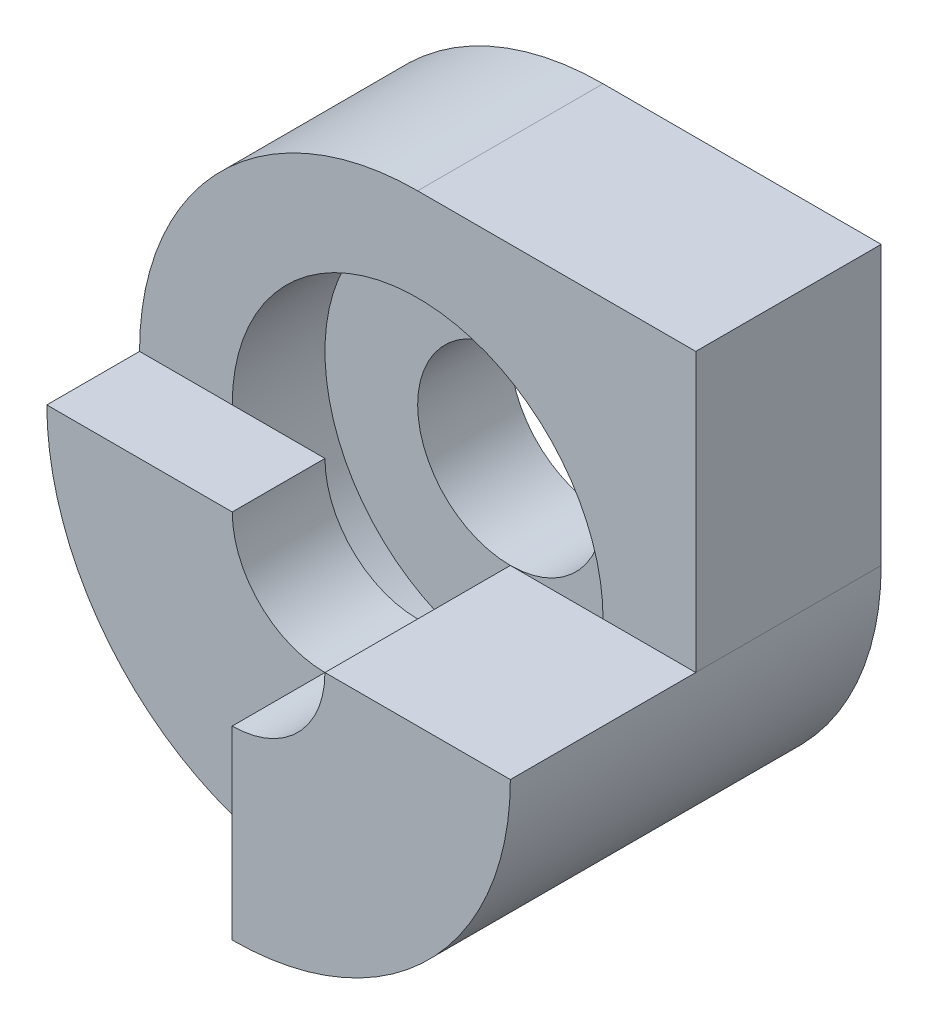
ISO-10303-21;
HEADER;
FILE_DESCRIPTION(('STEP AP214'),'2;1');
FILE_NAME('part.step','',(''),(''),'','','');
FILE_SCHEMA(('AUTOMOTIVE_DESIGN { 1 0 10303 214 1 1 1 1 }'));
ENDSEC;
DATA;
#1=APPLICATION_CONTEXT('core data for automotive mechanical design processes');
#2=APPLICATION_PROTOCOL_DEFINITION('international standard','automotive_design',2000,#1);
#3=PRODUCT_CONTEXT('',#1,'mechanical');
#4=PRODUCT('Part','Part','',(#3));
#5=PRODUCT_RELATED_PRODUCT_CATEGORY('part','',(#4));
#6=PRODUCT_DEFINITION_FORMATION('','',#4);
#7=PRODUCT_DEFINITION_CONTEXT('part definition',#1,'design');
#8=PRODUCT_DEFINITION('design','',#6,#7);
#9=PRODUCT_DEFINITION_SHAPE('','',#8);
#10=(LENGTH_UNIT() NAMED_UNIT(*) SI_UNIT(.MILLI.,.METRE.));
#11=(NAMED_UNIT(*) PLANE_ANGLE_UNIT() SI_UNIT($,.RADIAN.));
#12=(NAMED_UNIT(*) SI_UNIT($,.STERADIAN.) SOLID_ANGLE_UNIT());
#13=UNCERTAINTY_MEASURE_WITH_UNIT(LENGTH_MEASURE(1.E-05),#10,'distance_accuracy_value','');
#14=(GEOMETRIC_REPRESENTATION_CONTEXT(3) GLOBAL_UNCERTAINTY_ASSIGNED_CONTEXT((#13)) GLOBAL_UNIT_ASSIGNED_CONTEXT((#10,
#11,#12)) REPRESENTATION_CONTEXT('',''));
#15=CARTESIAN_POINT('',(0.,0.,0.));
#16=DIRECTION('',(0.,0.,1.));
#17=DIRECTION('',(1.,0.,0.));
#18=AXIS2_PLACEMENT_3D('',#15,#16,#17);
#19=CARTESIAN_POINT('',(0.,0.,2.));
#20=DIRECTION('',(0.,0.,-1.));
#21=DIRECTION('',(-1.,0.,0.));
#22=AXIS2_PLACEMENT_3D('',#19,#20,#21);
#23=PLANE('',#22);
#24=DIRECTION('',(-1.,0.,0.));
#25=VECTOR('',#24,1.);
#26=CARTESIAN_POINT('',(-3.,0.,2.));
#27=LINE('',#26,#25);
#28=CARTESIAN_POINT('',(-2.,0.,2.));
#29=VERTEX_POINT('',#28);
#30=CARTESIAN_POINT('',(-2.99999999999997,0.,2.));
#31=VERTEX_POINT('',#30);
#32=EDGE_CURVE('E140',#29,#31,#27,.T.);
#33=ORIENTED_EDGE('',*,*,#32,.F.);
#34=CARTESIAN_POINT('',(0.,0.,2.));
#35=DIRECTION('',(0.,0.,1.));
#36=DIRECTION('',(1.,0.,0.));
#37=AXIS2_PLACEMENT_3D('',#34,#35,#36);
#38=CIRCLE('',#37,2.);
#39=CARTESIAN_POINT('',(2.,0.,2.));
#40=VERTEX_POINT('',#39);
#41=EDGE_CURVE('E170',#40,#29,#38,.T.);
#42=ORIENTED_EDGE('',*,*,#41,.F.);
#43=DIRECTION('',(-1.,0.,0.));
#44=VECTOR('',#43,1.);
#45=CARTESIAN_POINT('',(2.99999999999991,0.,2.));
#46=LINE('',#45,#44);
#47=CARTESIAN_POINT('',(3.,0.,2.));
#48=VERTEX_POINT('',#47);
#49=EDGE_CURVE('E146',#48,#40,#46,.T.);
#50=ORIENTED_EDGE('',*,*,#49,.F.);
#51=DIRECTION('',(0.,1.,0.));
#52=VECTOR('',#51,1.);
#53=CARTESIAN_POINT('',(3.,0.,2.));
#54=LINE('',#53,#52);
#55=CARTESIAN_POINT('',(3.,3.,2.));
#56=VERTEX_POINT('',#55);
#57=EDGE_CURVE('E178',#48,#56,#54,.T.);
#58=ORIENTED_EDGE('',*,*,#57,.T.);
#59=DIRECTION('',(-1.,0.,0.));
#60=VECTOR('',#59,1.);
#61=CARTESIAN_POINT('',(3.,3.,2.));
#62=LINE('',#61,#60);
#63=CARTESIAN_POINT('',(0.,3.,2.));
#64=VERTEX_POINT('',#63);
#65=EDGE_CURVE('E181',#56,#64,#62,.T.);
#66=ORIENTED_EDGE('',*,*,#65,.T.);
#67=CARTESIAN_POINT('',(0.,0.,2.));
#68=DIRECTION('',(0.,0.,1.));
#69=DIRECTION('',(-1.,0.,0.));
#70=AXIS2_PLACEMENT_3D('',#67,#68,#69);
#71=CIRCLE('',#70,2.99999999999998);
#72=EDGE_CURVE('E49',#64,#31,#71,.T.);
#73=ORIENTED_EDGE('',*,*,#72,.T.);
#74=EDGE_LOOP('',(#33,#42,#50,#58,#66,#73));
#75=FACE_BOUND('',#74,.T.);
#76=ADVANCED_FACE('F33',(#75),#23,.F.);
#77=CARTESIAN_POINT('',(0.,-2.,4.));
#78=DIRECTION('',(1.,0.,0.));
#79=DIRECTION('',(0.,1.,0.));
#80=AXIS2_PLACEMENT_3D('',#77,#78,#79);
#81=PLANE('',#80);
#82=DIRECTION('',(0.,1.,0.));
#83=VECTOR('',#82,1.);
#84=CARTESIAN_POINT('',(0.,-2.,3.));
#85=LINE('',#84,#83);
#86=CARTESIAN_POINT('',(0.,-3.,3.));
#87=VERTEX_POINT('',#86);
#88=CARTESIAN_POINT('',(0.,-1.,3.));
#89=VERTEX_POINT('',#88);
#90=EDGE_CURVE('E116',#87,#89,#85,.T.);
#91=ORIENTED_EDGE('',*,*,#90,.F.);
#92=DIRECTION('',(0.,0.,-1.));
#93=VECTOR('',#92,1.);
#94=CARTESIAN_POINT('',(0.,-3.,4.));
#95=LINE('',#94,#93);
#96=CARTESIAN_POINT('',(0.,-3.,4.));
#97=VERTEX_POINT('',#96);
#98=EDGE_CURVE('E160',#97,#87,#95,.T.);
#99=ORIENTED_EDGE('',*,*,#98,.F.);
#100=DIRECTION('',(0.,-1.,0.));
#101=VECTOR('',#100,1.);
#102=CARTESIAN_POINT('',(0.,-1.,4.));
#103=LINE('',#102,#101);
#104=CARTESIAN_POINT('',(0.,-1.,4.));
#105=VERTEX_POINT('',#104);
#106=EDGE_CURVE('E148',#105,#97,#103,.T.);
#107=ORIENTED_EDGE('',*,*,#106,.F.);
#108=DIRECTION('',(0.,0.,-1.));
#109=VECTOR('',#108,1.);
#110=CARTESIAN_POINT('',(0.,-1.,4.));
#111=LINE('',#110,#109);
#112=EDGE_CURVE('E163',#105,#89,#111,.T.);
#113=ORIENTED_EDGE('',*,*,#112,.T.);
#114=EDGE_LOOP('',(#91,#99,#107,#113));
#115=FACE_BOUND('',#114,.T.);
#116=ADVANCED_FACE('F217',(#115),#81,.F.);
#117=CARTESIAN_POINT('',(0.,0.,2.));
#118=DIRECTION('',(0.,0.,-1.));
#119=DIRECTION('',(-1.,0.,0.));
#120=AXIS2_PLACEMENT_3D('',#117,#118,#119);
#121=CYLINDRICAL_SURFACE('',#120,1.);
#122=CARTESIAN_POINT('',(0.,0.,0.));
#123=DIRECTION('',(0.,0.,1.));
#124=DIRECTION('',(1.,0.,0.));
#125=AXIS2_PLACEMENT_3D('',#122,#123,#124);
#126=CIRCLE('',#125,1.);
#127=CARTESIAN_POINT('',(1.,0.,0.));
#128=VERTEX_POINT('',#127);
#129=EDGE_CURVE('E173',#128,#128,#126,.T.);
#130=ORIENTED_EDGE('',*,*,#129,.F.);
#131=EDGE_LOOP('',(#130));
#132=FACE_BOUND('',#131,.T.);
#133=CARTESIAN_POINT('',(0.,0.,1.));
#134=DIRECTION('',(0.,0.,1.));
#135=DIRECTION('',(1.,0.,0.));
#136=AXIS2_PLACEMENT_3D('',#133,#134,#135);
#137=CIRCLE('',#136,1.);
#138=CARTESIAN_POINT('',(1.,0.,1.));
#139=VERTEX_POINT('',#138);
#140=EDGE_CURVE('E37',#139,#139,#137,.T.);
#141=ORIENTED_EDGE('',*,*,#140,.T.);
#142=EDGE_LOOP('',(#141));
#143=FACE_BOUND('',#142,.T.);
#144=ADVANCED_FACE('F214',(#132,#143),#121,.F.);
#145=CARTESIAN_POINT('',(0.,0.,0.));
#146=DIRECTION('',(0.,0.,-1.));
#147=DIRECTION('',(-1.,0.,0.));
#148=AXIS2_PLACEMENT_3D('',#145,#146,#147);
#149=PLANE('',#148);
#150=DIRECTION('',(0.,1.,0.));
#151=VECTOR('',#150,1.);
#152=CARTESIAN_POINT('',(3.,0.,0.));
#153=LINE('',#152,#151);
#154=CARTESIAN_POINT('',(3.,0.,0.));
#155=VERTEX_POINT('',#154);
#156=CARTESIAN_POINT('',(3.,3.,0.));
#157=VERTEX_POINT('',#156);
#158=EDGE_CURVE('E176',#155,#157,#153,.T.);
#159=ORIENTED_EDGE('',*,*,#158,.F.);
#160=CARTESIAN_POINT('',(0.,0.,0.));
#161=DIRECTION('',(0.,0.,1.));
#162=DIRECTION('',(1.,0.,0.));
#163=AXIS2_PLACEMENT_3D('',#160,#161,#162);
#164=CIRCLE('',#163,3.);
#165=CARTESIAN_POINT('',(0.,3.,0.));
#166=VERTEX_POINT('',#165);
#167=EDGE_CURVE('E179',#166,#155,#164,.T.);
#168=ORIENTED_EDGE('',*,*,#167,.F.);
#169=DIRECTION('',(-1.,0.,0.));
#170=VECTOR('',#169,1.);
#171=CARTESIAN_POINT('',(3.,3.,0.));
#172=LINE('',#171,#170);
#173=EDGE_CURVE('E185',#157,#166,#172,.T.);
#174=ORIENTED_EDGE('',*,*,#173,.F.);
#175=EDGE_LOOP('',(#159,#168,#174));
#176=FACE_BOUND('',#175,.T.);
#177=ORIENTED_EDGE('',*,*,#129,.T.);
#178=EDGE_LOOP('',(#177));
#179=FACE_BOUND('',#178,.T.);
#180=ADVANCED_FACE('F202',(#176,#179),#149,.T.);
#181=CARTESIAN_POINT('',(3.,0.,2.));
#182=DIRECTION('',(-1.,0.,0.));
#183=DIRECTION('',(0.,0.,1.));
#184=AXIS2_PLACEMENT_3D('',#181,#182,#183);
#185=PLANE('',#184);
#186=ORIENTED_EDGE('',*,*,#158,.T.);
#187=DIRECTION('',(0.,0.,-1.));
#188=VECTOR('',#187,1.);
#189=CARTESIAN_POINT('',(3.,3.,2.));
#190=LINE('',#189,#188);
#191=EDGE_CURVE('E42',#56,#157,#190,.T.);
#192=ORIENTED_EDGE('',*,*,#191,.F.);
#193=ORIENTED_EDGE('',*,*,#57,.F.);
#194=DIRECTION('',(0.,0.,-1.));
#195=VECTOR('',#194,1.);
#196=CARTESIAN_POINT('',(3.,0.,2.));
#197=LINE('',#196,#195);
#198=EDGE_CURVE('E11',#48,#155,#197,.T.);
#199=ORIENTED_EDGE('',*,*,#198,.T.);
#200=EDGE_LOOP('',(#186,#192,#193,#199));
#201=FACE_BOUND('',#200,.T.);
#202=ADVANCED_FACE('F35',(#201),#185,.F.);
#203=CARTESIAN_POINT('',(3.,3.,2.));
#204=DIRECTION('',(0.,-1.,0.));
#205=DIRECTION('',(0.,0.,-1.));
#206=AXIS2_PLACEMENT_3D('',#203,#204,#205);
#207=PLANE('',#206);
#208=ORIENTED_EDGE('',*,*,#173,.T.);
#209=DIRECTION('',(0.,0.,-1.));
#210=VECTOR('',#209,1.);
#211=CARTESIAN_POINT('',(0.,3.,2.));
#212=LINE('',#211,#210);
#213=EDGE_CURVE('E183',#64,#166,#212,.T.);
#214=ORIENTED_EDGE('',*,*,#213,.F.);
#215=ORIENTED_EDGE('',*,*,#65,.F.);
#216=ORIENTED_EDGE('',*,*,#191,.T.);
#217=EDGE_LOOP('',(#208,#214,#215,#216));
#218=FACE_BOUND('',#217,.T.);
#219=ADVANCED_FACE('F195',(#218),#207,.F.);
#220=CARTESIAN_POINT('',(0.,0.,2.));
#221=DIRECTION('',(0.,0.,-1.));
#222=DIRECTION('',(-1.,0.,0.));
#223=AXIS2_PLACEMENT_3D('',#220,#221,#222);
#224=CYLINDRICAL_SURFACE('',#223,3.);
#225=ORIENTED_EDGE('',*,*,#167,.T.);
#226=ORIENTED_EDGE('',*,*,#198,.F.);
#227=DIRECTION('',(0.,0.,-1.));
#228=VECTOR('',#227,1.);
#229=CARTESIAN_POINT('',(2.99999999999991,0.,4.));
#230=LINE('',#229,#228);
#231=CARTESIAN_POINT('',(2.99999999999991,0.,4.));
#232=VERTEX_POINT('',#231);
#233=EDGE_CURVE('E153',#232,#48,#230,.T.);
#234=ORIENTED_EDGE('',*,*,#233,.F.);
#235=CARTESIAN_POINT('',(0.,0.,4.));
#236=DIRECTION('',(0.,0.,1.));
#237=DIRECTION('',(-1.,0.,0.));
#238=AXIS2_PLACEMENT_3D('',#235,#236,#237);
#239=CIRCLE('',#238,2.99999999999994);
#240=EDGE_CURVE('E150',#97,#232,#239,.T.);
#241=ORIENTED_EDGE('',*,*,#240,.F.);
#242=ORIENTED_EDGE('',*,*,#98,.T.);
#243=CARTESIAN_POINT('',(0.,0.,3.));
#244=DIRECTION('',(0.,0.,1.));
#245=DIRECTION('',(-1.,0.,0.));
#246=AXIS2_PLACEMENT_3D('',#243,#244,#245);
#247=CIRCLE('',#246,3.00000000000001);
#248=CARTESIAN_POINT('',(-3.,0.,3.));
#249=VERTEX_POINT('',#248);
#250=EDGE_CURVE('E133',#249,#87,#247,.T.);
#251=ORIENTED_EDGE('',*,*,#250,.F.);
#252=DIRECTION('',(0.,0.,-1.));
#253=VECTOR('',#252,1.);
#254=CARTESIAN_POINT('',(-3.,0.,3.));
#255=LINE('',#254,#253);
#256=EDGE_CURVE('E128',#249,#31,#255,.T.);
#257=ORIENTED_EDGE('',*,*,#256,.T.);
#258=ORIENTED_EDGE('',*,*,#72,.F.);
#259=ORIENTED_EDGE('',*,*,#213,.T.);
#260=EDGE_LOOP('',(#225,#226,#234,#241,#242,#251,#257,#258,#259));
#261=FACE_BOUND('',#260,.T.);
#262=ADVANCED_FACE('F206',(#261),#224,.T.);
#263=CARTESIAN_POINT('',(0.,0.,1.));
#264=DIRECTION('',(0.,0.,1.));
#265=DIRECTION('',(1.,0.,0.));
#266=AXIS2_PLACEMENT_3D('',#263,#264,#265);
#267=CYLINDRICAL_SURFACE('',#266,2.);
#268=CARTESIAN_POINT('',(0.,0.,1.));
#269=DIRECTION('',(0.,0.,1.));
#270=DIRECTION('',(1.,0.,0.));
#271=AXIS2_PLACEMENT_3D('',#268,#269,#270);
#272=CIRCLE('',#271,2.);
#273=CARTESIAN_POINT('',(2.,0.,1.));
#274=VERTEX_POINT('',#273);
#275=EDGE_CURVE('E167',#274,#274,#272,.T.);
#276=ORIENTED_EDGE('',*,*,#275,.F.);
#277=EDGE_LOOP('',(#276));
#278=FACE_BOUND('',#277,.T.);
#279=ORIENTED_EDGE('',*,*,#41,.T.);
#280=EDGE_CURVE('E57',#29,#40,#38,.T.);
#281=ORIENTED_EDGE('',*,*,#280,.T.);
#282=EDGE_LOOP('',(#279,#281));
#283=FACE_BOUND('',#282,.T.);
#284=ADVANCED_FACE('F228',(#278,#283),#267,.F.);
#285=CARTESIAN_POINT('',(0.,0.,1.));
#286=DIRECTION('',(0.,0.,1.));
#287=DIRECTION('',(1.,0.,0.));
#288=AXIS2_PLACEMENT_3D('',#285,#286,#287);
#289=PLANE('',#288);
#290=ORIENTED_EDGE('',*,*,#140,.F.);
#291=EDGE_LOOP('',(#290));
#292=FACE_BOUND('',#291,.T.);
#293=ORIENTED_EDGE('',*,*,#275,.T.);
#294=EDGE_LOOP('',(#293));
#295=FACE_BOUND('',#294,.T.);
#296=ADVANCED_FACE('F232',(#292,#295),#289,.T.);
#297=CARTESIAN_POINT('',(0.,0.,2.));
#298=DIRECTION('',(0.,0.,-1.));
#299=DIRECTION('',(-1.,0.,0.));
#300=AXIS2_PLACEMENT_3D('',#297,#298,#299);
#301=PLANE('',#300);
#302=ORIENTED_EDGE('',*,*,#280,.F.);
#303=CARTESIAN_POINT('',(-1.,0.,2.));
#304=VERTEX_POINT('',#303);
#305=EDGE_CURVE('E138',#304,#29,#27,.T.);
#306=ORIENTED_EDGE('',*,*,#305,.F.);
#307=CARTESIAN_POINT('',(0.,0.,2.));
#308=DIRECTION('',(0.,0.,-1.));
#309=DIRECTION('',(-1.,0.,0.));
#310=AXIS2_PLACEMENT_3D('',#307,#308,#309);
#311=CIRCLE('',#310,1.);
#312=CARTESIAN_POINT('',(1.,0.,2.));
#313=VERTEX_POINT('',#312);
#314=EDGE_CURVE('E125',#313,#304,#311,.T.);
#315=ORIENTED_EDGE('',*,*,#314,.F.);
#316=EDGE_CURVE('E155',#40,#313,#46,.T.);
#317=ORIENTED_EDGE('',*,*,#316,.F.);
#318=EDGE_LOOP('',(#302,#306,#315,#317));
#319=FACE_BOUND('',#318,.T.);
#320=ADVANCED_FACE('F237',(#319),#301,.T.);
#321=CARTESIAN_POINT('',(0.,0.,4.));
#322=DIRECTION('',(0.,0.,-1.));
#323=DIRECTION('',(-1.,0.,0.));
#324=AXIS2_PLACEMENT_3D('',#321,#322,#323);
#325=CYLINDRICAL_SURFACE('',#324,1.);
#326=ORIENTED_EDGE('',*,*,#314,.T.);
#327=DIRECTION('',(0.,0.,-1.));
#328=VECTOR('',#327,1.);
#329=CARTESIAN_POINT('',(-1.,0.,3.));
#330=LINE('',#329,#328);
#331=CARTESIAN_POINT('',(-1.,0.,3.));
#332=VERTEX_POINT('',#331);
#333=EDGE_CURVE('E121',#332,#304,#330,.T.);
#334=ORIENTED_EDGE('',*,*,#333,.F.);
#335=CARTESIAN_POINT('',(0.,0.,3.));
#336=DIRECTION('',(0.,0.,-1.));
#337=DIRECTION('',(-1.,0.,0.));
#338=AXIS2_PLACEMENT_3D('',#335,#336,#337);
#339=CIRCLE('',#338,0.999999999999984);
#340=EDGE_CURVE('E109',#89,#332,#339,.T.);
#341=ORIENTED_EDGE('',*,*,#340,.F.);
#342=ORIENTED_EDGE('',*,*,#112,.F.);
#343=CARTESIAN_POINT('',(0.,0.,4.));
#344=DIRECTION('',(0.,0.,-1.));
#345=DIRECTION('',(-1.,0.,0.));
#346=AXIS2_PLACEMENT_3D('',#343,#344,#345);
#347=CIRCLE('',#346,1.);
#348=CARTESIAN_POINT('',(1.,0.,4.));
#349=VERTEX_POINT('',#348);
#350=EDGE_CURVE('E145',#349,#105,#347,.T.);
#351=ORIENTED_EDGE('',*,*,#350,.F.);
#352=DIRECTION('',(0.,0.,-1.));
#353=VECTOR('',#352,1.);
#354=CARTESIAN_POINT('',(1.,0.,4.));
#355=LINE('',#354,#353);
#356=EDGE_CURVE('E165',#349,#313,#355,.T.);
#357=ORIENTED_EDGE('',*,*,#356,.T.);
#358=EDGE_LOOP('',(#326,#334,#341,#342,#351,#357));
#359=FACE_BOUND('',#358,.T.);
#360=ADVANCED_FACE('F122',(#359),#325,.F.);
#361=CARTESIAN_POINT('',(2.99999999999991,0.,4.));
#362=DIRECTION('',(0.,-1.,0.));
#363=DIRECTION('',(1.,0.,0.));
#364=AXIS2_PLACEMENT_3D('',#361,#362,#363);
#365=PLANE('',#364);
#366=ORIENTED_EDGE('',*,*,#49,.T.);
#367=ORIENTED_EDGE('',*,*,#316,.T.);
#368=ORIENTED_EDGE('',*,*,#356,.F.);
#369=DIRECTION('',(-1.,0.,0.));
#370=VECTOR('',#369,1.);
#371=CARTESIAN_POINT('',(2.,0.,4.));
#372=LINE('',#371,#370);
#373=EDGE_CURVE('E142',#232,#349,#372,.T.);
#374=ORIENTED_EDGE('',*,*,#373,.F.);
#375=ORIENTED_EDGE('',*,*,#233,.T.);
#376=EDGE_LOOP('',(#366,#367,#368,#374,#375));
#377=FACE_BOUND('',#376,.T.);
#378=ADVANCED_FACE('F244',(#377),#365,.F.);
#379=CARTESIAN_POINT('',(0.,0.,4.));
#380=DIRECTION('',(0.,0.,-1.));
#381=DIRECTION('',(-1.,0.,0.));
#382=AXIS2_PLACEMENT_3D('',#379,#380,#381);
#383=PLANE('',#382);
#384=ORIENTED_EDGE('',*,*,#373,.T.);
#385=ORIENTED_EDGE('',*,*,#350,.T.);
#386=ORIENTED_EDGE('',*,*,#106,.T.);
#387=ORIENTED_EDGE('',*,*,#240,.T.);
#388=EDGE_LOOP('',(#384,#385,#386,#387));
#389=FACE_BOUND('',#388,.T.);
#390=ADVANCED_FACE('F248',(#389),#383,.F.);
#391=CARTESIAN_POINT('',(-3.,0.,3.));
#392=DIRECTION('',(0.,-1.,0.));
#393=DIRECTION('',(1.,0.,0.));
#394=AXIS2_PLACEMENT_3D('',#391,#392,#393);
#395=PLANE('',#394);
#396=ORIENTED_EDGE('',*,*,#305,.T.);
#397=ORIENTED_EDGE('',*,*,#32,.T.);
#398=ORIENTED_EDGE('',*,*,#256,.F.);
#399=DIRECTION('',(-1.,0.,0.));
#400=VECTOR('',#399,1.);
#401=CARTESIAN_POINT('',(-1.,0.,3.));
#402=LINE('',#401,#400);
#403=EDGE_CURVE('E114',#332,#249,#402,.T.);
#404=ORIENTED_EDGE('',*,*,#403,.F.);
#405=ORIENTED_EDGE('',*,*,#333,.T.);
#406=EDGE_LOOP('',(#396,#397,#398,#404,#405));
#407=FACE_BOUND('',#406,.T.);
#408=ADVANCED_FACE('F130',(#407),#395,.F.);
#409=CARTESIAN_POINT('',(0.,0.,3.));
#410=DIRECTION('',(0.,0.,-1.));
#411=DIRECTION('',(-1.,0.,0.));
#412=AXIS2_PLACEMENT_3D('',#409,#410,#411);
#413=PLANE('',#412);
#414=ORIENTED_EDGE('',*,*,#90,.T.);
#415=ORIENTED_EDGE('',*,*,#340,.T.);
#416=ORIENTED_EDGE('',*,*,#403,.T.);
#417=ORIENTED_EDGE('',*,*,#250,.T.);
#418=EDGE_LOOP('',(#414,#415,#416,#417));
#419=FACE_BOUND('',#418,.T.);
#420=ADVANCED_FACE('F111',(#419),#413,.F.);
#421=CLOSED_SHELL('',(#76,#116,#144,#180,#202,#219,#262,#284,#296,#320,#360,#378,#390,#408,#420));
#422=MANIFOLD_SOLID_BREP('B2',#421);
#423=ADVANCED_BREP_SHAPE_REPRESENTATION('',(#18,#422),#14);
#424=SHAPE_DEFINITION_REPRESENTATION(#9,#423);
ENDSEC;
END-ISO-10303-21;
